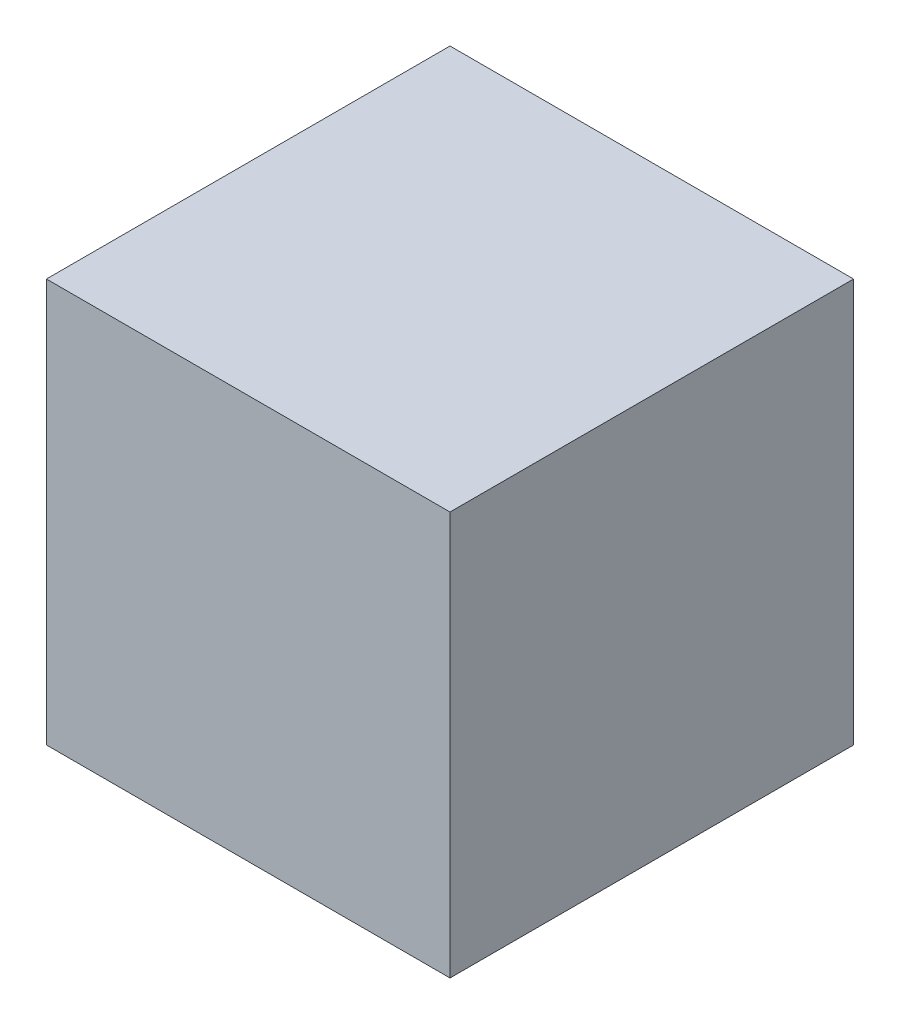
ISO-10303-21;
HEADER;
FILE_DESCRIPTION(('STEP AP214'),'2;1');
FILE_NAME('part.step','',(''),(''),'','','');
FILE_SCHEMA(('AUTOMOTIVE_DESIGN { 1 0 10303 214 1 1 1 1 }'));
ENDSEC;
DATA;
#1=APPLICATION_CONTEXT('core data for automotive mechanical design processes');
#2=APPLICATION_PROTOCOL_DEFINITION('international standard','automotive_design',2000,#1);
#3=PRODUCT_CONTEXT('',#1,'mechanical');
#4=PRODUCT('Part','Part','',(#3));
#5=PRODUCT_RELATED_PRODUCT_CATEGORY('part','',(#4));
#6=PRODUCT_DEFINITION_FORMATION('','',#4);
#7=PRODUCT_DEFINITION_CONTEXT('part definition',#1,'design');
#8=PRODUCT_DEFINITION('design','',#6,#7);
#9=PRODUCT_DEFINITION_SHAPE('','',#8);
#10=(LENGTH_UNIT() NAMED_UNIT(*) SI_UNIT(.MILLI.,.METRE.));
#11=(NAMED_UNIT(*) PLANE_ANGLE_UNIT() SI_UNIT($,.RADIAN.));
#12=(NAMED_UNIT(*) SI_UNIT($,.STERADIAN.) SOLID_ANGLE_UNIT());
#13=UNCERTAINTY_MEASURE_WITH_UNIT(LENGTH_MEASURE(1.E-05),#10,'distance_accuracy_value','');
#14=(GEOMETRIC_REPRESENTATION_CONTEXT(3) GLOBAL_UNCERTAINTY_ASSIGNED_CONTEXT((#13)) GLOBAL_UNIT_ASSIGNED_CONTEXT((#10,
#11,#12)) REPRESENTATION_CONTEXT('',''));
#15=CARTESIAN_POINT('',(0.,0.,0.));
#16=DIRECTION('',(0.,0.,1.));
#17=DIRECTION('',(1.,0.,0.));
#18=AXIS2_PLACEMENT_3D('',#15,#16,#17);
#19=CARTESIAN_POINT('',(0.,304.8,0.));
#20=DIRECTION('',(1.,0.,0.));
#21=DIRECTION('',(0.,0.,-1.));
#22=AXIS2_PLACEMENT_3D('',#19,#20,#21);
#23=PLANE('',#22);
#24=DIRECTION('',(0.,0.,1.));
#25=VECTOR('',#24,1.);
#26=CARTESIAN_POINT('',(0.,0.,0.));
#27=LINE('',#26,#25);
#28=CARTESIAN_POINT('',(0.,0.,-304.8));
#29=VERTEX_POINT('',#28);
#30=CARTESIAN_POINT('',(0.,0.,0.));
#31=VERTEX_POINT('',#30);
#32=EDGE_CURVE('E75',#29,#31,#27,.T.);
#33=ORIENTED_EDGE('',*,*,#32,.T.);
#34=DIRECTION('',(0.,-1.,0.));
#35=VECTOR('',#34,1.);
#36=CARTESIAN_POINT('',(0.,304.8,0.));
#37=LINE('',#36,#35);
#38=CARTESIAN_POINT('',(0.,304.8,0.));
#39=VERTEX_POINT('',#38);
#40=EDGE_CURVE('E11',#39,#31,#37,.T.);
#41=ORIENTED_EDGE('',*,*,#40,.F.);
#42=DIRECTION('',(0.,0.,1.));
#43=VECTOR('',#42,1.);
#44=CARTESIAN_POINT('',(0.,304.8,0.));
#45=LINE('',#44,#43);
#46=CARTESIAN_POINT('',(0.,304.8,-304.8));
#47=VERTEX_POINT('',#46);
#48=EDGE_CURVE('E93',#47,#39,#45,.T.);
#49=ORIENTED_EDGE('',*,*,#48,.F.);
#50=DIRECTION('',(0.,-1.,0.));
#51=VECTOR('',#50,1.);
#52=CARTESIAN_POINT('',(0.,304.8,-304.8));
#53=LINE('',#52,#51);
#54=EDGE_CURVE('E87',#47,#29,#53,.T.);
#55=ORIENTED_EDGE('',*,*,#54,.T.);
#56=EDGE_LOOP('',(#33,#41,#49,#55));
#57=FACE_BOUND('',#56,.T.);
#58=ADVANCED_FACE('F31',(#57),#23,.F.);
#59=CARTESIAN_POINT('',(0.,304.8,0.));
#60=DIRECTION('',(0.,0.,-1.));
#61=DIRECTION('',(-1.,0.,0.));
#62=AXIS2_PLACEMENT_3D('',#59,#60,#61);
#63=PLANE('',#62);
#64=DIRECTION('',(1.,0.,0.));
#65=VECTOR('',#64,1.);
#66=CARTESIAN_POINT('',(0.,0.,0.));
#67=LINE('',#66,#65);
#68=CARTESIAN_POINT('',(304.8,0.,0.));
#69=VERTEX_POINT('',#68);
#70=EDGE_CURVE('E71',#31,#69,#67,.T.);
#71=ORIENTED_EDGE('',*,*,#70,.T.);
#72=DIRECTION('',(0.,-1.,0.));
#73=VECTOR('',#72,1.);
#74=CARTESIAN_POINT('',(304.8,304.8,0.));
#75=LINE('',#74,#73);
#76=CARTESIAN_POINT('',(304.8,304.8,0.));
#77=VERTEX_POINT('',#76);
#78=EDGE_CURVE('E38',#77,#69,#75,.T.);
#79=ORIENTED_EDGE('',*,*,#78,.F.);
#80=DIRECTION('',(1.,0.,0.));
#81=VECTOR('',#80,1.);
#82=CARTESIAN_POINT('',(0.,304.8,0.));
#83=LINE('',#82,#81);
#84=EDGE_CURVE('E83',#39,#77,#83,.T.);
#85=ORIENTED_EDGE('',*,*,#84,.F.);
#86=ORIENTED_EDGE('',*,*,#40,.T.);
#87=EDGE_LOOP('',(#71,#79,#85,#86));
#88=FACE_BOUND('',#87,.T.);
#89=ADVANCED_FACE('F82',(#88),#63,.F.);
#90=CARTESIAN_POINT('',(304.8,304.8,0.));
#91=DIRECTION('',(-1.,0.,0.));
#92=DIRECTION('',(0.,0.,1.));
#93=AXIS2_PLACEMENT_3D('',#90,#91,#92);
#94=PLANE('',#93);
#95=DIRECTION('',(0.,0.,-1.));
#96=VECTOR('',#95,1.);
#97=CARTESIAN_POINT('',(304.8,0.,0.));
#98=LINE('',#97,#96);
#99=CARTESIAN_POINT('',(304.8,0.,-304.8));
#100=VERTEX_POINT('',#99);
#101=EDGE_CURVE('E76',#69,#100,#98,.T.);
#102=ORIENTED_EDGE('',*,*,#101,.T.);
#103=DIRECTION('',(0.,-1.,0.));
#104=VECTOR('',#103,1.);
#105=CARTESIAN_POINT('',(304.8,304.8,-304.8));
#106=LINE('',#105,#104);
#107=CARTESIAN_POINT('',(304.8,304.8,-304.8));
#108=VERTEX_POINT('',#107);
#109=EDGE_CURVE('E99',#108,#100,#106,.T.);
#110=ORIENTED_EDGE('',*,*,#109,.F.);
#111=DIRECTION('',(0.,0.,-1.));
#112=VECTOR('',#111,1.);
#113=CARTESIAN_POINT('',(304.8,304.8,0.));
#114=LINE('',#113,#112);
#115=EDGE_CURVE('E50',#77,#108,#114,.T.);
#116=ORIENTED_EDGE('',*,*,#115,.F.);
#117=ORIENTED_EDGE('',*,*,#78,.T.);
#118=EDGE_LOOP('',(#102,#110,#116,#117));
#119=FACE_BOUND('',#118,.T.);
#120=ADVANCED_FACE('F102',(#119),#94,.F.);
#121=CARTESIAN_POINT('',(0.,304.8,-304.8));
#122=DIRECTION('',(0.,0.,1.));
#123=DIRECTION('',(1.,0.,0.));
#124=AXIS2_PLACEMENT_3D('',#121,#122,#123);
#125=PLANE('',#124);
#126=DIRECTION('',(-1.,0.,0.));
#127=VECTOR('',#126,1.);
#128=CARTESIAN_POINT('',(0.,0.,-304.8));
#129=LINE('',#128,#127);
#130=EDGE_CURVE('E91',#100,#29,#129,.T.);
#131=ORIENTED_EDGE('',*,*,#130,.T.);
#132=ORIENTED_EDGE('',*,*,#54,.F.);
#133=DIRECTION('',(-1.,0.,0.));
#134=VECTOR('',#133,1.);
#135=CARTESIAN_POINT('',(0.,304.8,-304.8));
#136=LINE('',#135,#134);
#137=EDGE_CURVE('E45',#108,#47,#136,.T.);
#138=ORIENTED_EDGE('',*,*,#137,.F.);
#139=ORIENTED_EDGE('',*,*,#109,.T.);
#140=EDGE_LOOP('',(#131,#132,#138,#139));
#141=FACE_BOUND('',#140,.T.);
#142=ADVANCED_FACE('F104',(#141),#125,.F.);
#143=CARTESIAN_POINT('',(0.,304.8,-304.8));
#144=DIRECTION('',(0.,-1.,0.));
#145=DIRECTION('',(0.,0.,-1.));
#146=AXIS2_PLACEMENT_3D('',#143,#144,#145);
#147=PLANE('',#146);
#148=ORIENTED_EDGE('',*,*,#48,.T.);
#149=ORIENTED_EDGE('',*,*,#84,.T.);
#150=ORIENTED_EDGE('',*,*,#115,.T.);
#151=ORIENTED_EDGE('',*,*,#137,.T.);
#152=EDGE_LOOP('',(#148,#149,#150,#151));
#153=FACE_BOUND('',#152,.T.);
#154=ADVANCED_FACE('F105',(#153),#147,.F.);
#155=CARTESIAN_POINT('',(0.,0.,-304.8));
#156=DIRECTION('',(0.,-1.,0.));
#157=DIRECTION('',(0.,0.,-1.));
#158=AXIS2_PLACEMENT_3D('',#155,#156,#157);
#159=PLANE('',#158);
#160=ORIENTED_EDGE('',*,*,#32,.F.);
#161=ORIENTED_EDGE('',*,*,#130,.F.);
#162=ORIENTED_EDGE('',*,*,#101,.F.);
#163=ORIENTED_EDGE('',*,*,#70,.F.);
#164=EDGE_LOOP('',(#160,#161,#162,#163));
#165=FACE_BOUND('',#164,.T.);
#166=ADVANCED_FACE('F72',(#165),#159,.T.);
#167=CLOSED_SHELL('',(#58,#89,#120,#142,#154,#166));
#168=MANIFOLD_SOLID_BREP('B2',#167);
#169=ADVANCED_BREP_SHAPE_REPRESENTATION('',(#18,#168),#14);
#170=SHAPE_DEFINITION_REPRESENTATION(#9,#169);
ENDSEC;
END-ISO-10303-21;
